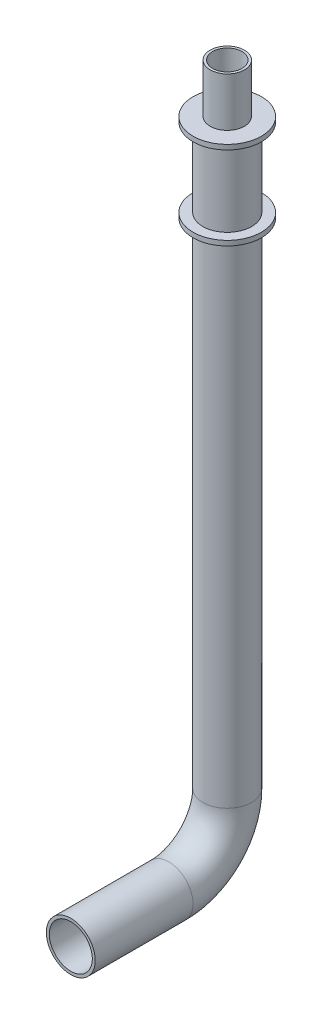
ISO-10303-21;
HEADER;
FILE_DESCRIPTION(('STEP AP214'),'2;1');
FILE_NAME('part.step','',(''),(''),'','','');
FILE_SCHEMA(('AUTOMOTIVE_DESIGN { 1 0 10303 214 1 1 1 1 }'));
ENDSEC;
DATA;
#1=APPLICATION_CONTEXT('core data for automotive mechanical design processes');
#2=APPLICATION_PROTOCOL_DEFINITION('international standard','automotive_design',2000,#1);
#3=PRODUCT_CONTEXT('',#1,'mechanical');
#4=PRODUCT('Part','Part','',(#3));
#5=PRODUCT_RELATED_PRODUCT_CATEGORY('part','',(#4));
#6=PRODUCT_DEFINITION_FORMATION('','',#4);
#7=PRODUCT_DEFINITION_CONTEXT('part definition',#1,'design');
#8=PRODUCT_DEFINITION('design','',#6,#7);
#9=PRODUCT_DEFINITION_SHAPE('','',#8);
#10=(LENGTH_UNIT() NAMED_UNIT(*) SI_UNIT(.MILLI.,.METRE.));
#11=(NAMED_UNIT(*) PLANE_ANGLE_UNIT() SI_UNIT($,.RADIAN.));
#12=(NAMED_UNIT(*) SI_UNIT($,.STERADIAN.) SOLID_ANGLE_UNIT());
#13=UNCERTAINTY_MEASURE_WITH_UNIT(LENGTH_MEASURE(1.E-05),#10,'distance_accuracy_value','');
#14=(GEOMETRIC_REPRESENTATION_CONTEXT(3) GLOBAL_UNCERTAINTY_ASSIGNED_CONTEXT((#13)) GLOBAL_UNIT_ASSIGNED_CONTEXT((#10,
#11,#12)) REPRESENTATION_CONTEXT('',''));
#15=CARTESIAN_POINT('',(0.,0.,0.));
#16=DIRECTION('',(0.,0.,1.));
#17=DIRECTION('',(1.,0.,0.));
#18=AXIS2_PLACEMENT_3D('',#15,#16,#17);
#19=CARTESIAN_POINT('',(0.,59.9999999999999,0.));
#20=DIRECTION('',(0.,1.,0.));
#21=DIRECTION('',(0.,0.,1.));
#22=AXIS2_PLACEMENT_3D('',#19,#20,#21);
#23=CYLINDRICAL_SURFACE('',#22,25.);
#24=CARTESIAN_POINT('',(0.,650.,0.));
#25=DIRECTION('',(0.,1.,0.));
#26=DIRECTION('',(0.,0.,1.));
#27=AXIS2_PLACEMENT_3D('',#24,#25,#26);
#28=CIRCLE('',#27,25.);
#29=CARTESIAN_POINT('',(0.,650.,25.));
#30=VERTEX_POINT('',#29);
#31=EDGE_CURVE('E101',#30,#30,#28,.T.);
#32=ORIENTED_EDGE('',*,*,#31,.F.);
#33=EDGE_LOOP('',(#32));
#34=FACE_BOUND('',#33,.T.);
#35=CARTESIAN_POINT('',(0.,570.,0.));
#36=DIRECTION('',(0.,-1.,0.));
#37=DIRECTION('',(0.,0.,-1.));
#38=AXIS2_PLACEMENT_3D('',#35,#36,#37);
#39=CIRCLE('',#38,25.);
#40=CARTESIAN_POINT('',(0.,570.,-25.));
#41=VERTEX_POINT('',#40);
#42=EDGE_CURVE('E63',#41,#41,#39,.F.);
#43=ORIENTED_EDGE('',*,*,#42,.T.);
#44=EDGE_LOOP('',(#43));
#45=FACE_BOUND('',#44,.T.);
#46=ADVANCED_FACE('F46',(#34,#45),#23,.T.);
#47=CARTESIAN_POINT('',(0.,650.,0.));
#48=DIRECTION('',(0.,1.,0.));
#49=DIRECTION('',(0.,0.,1.));
#50=AXIS2_PLACEMENT_3D('',#47,#48,#49);
#51=PLANE('',#50);
#52=ORIENTED_EDGE('',*,*,#31,.T.);
#53=EDGE_LOOP('',(#52));
#54=FACE_BOUND('',#53,.T.);
#55=CARTESIAN_POINT('',(0.,650.,0.));
#56=DIRECTION('',(0.,1.,0.));
#57=DIRECTION('',(0.,0.,1.));
#58=AXIS2_PLACEMENT_3D('',#55,#56,#57);
#59=CIRCLE('',#58,35.);
#60=CARTESIAN_POINT('',(0.,650.,35.));
#61=VERTEX_POINT('',#60);
#62=EDGE_CURVE('E72',#61,#61,#59,.T.);
#63=ORIENTED_EDGE('',*,*,#62,.F.);
#64=EDGE_LOOP('',(#63));
#65=FACE_BOUND('',#64,.T.);
#66=ADVANCED_FACE('F128',(#54,#65),#51,.F.);
#67=CARTESIAN_POINT('',(0.,655.,0.));
#68=DIRECTION('',(0.,1.,0.));
#69=DIRECTION('',(0.,0.,1.));
#70=AXIS2_PLACEMENT_3D('',#67,#68,#69);
#71=PLANE('',#70);
#72=CARTESIAN_POINT('',(0.,655.,0.));
#73=DIRECTION('',(0.,1.,0.));
#74=DIRECTION('',(0.,0.,1.));
#75=AXIS2_PLACEMENT_3D('',#72,#73,#74);
#76=CIRCLE('',#75,17.5);
#77=CARTESIAN_POINT('',(0.,655.,17.5));
#78=VERTEX_POINT('',#77);
#79=EDGE_CURVE('E68',#78,#78,#76,.T.);
#80=ORIENTED_EDGE('',*,*,#79,.F.);
#81=EDGE_LOOP('',(#80));
#82=FACE_BOUND('',#81,.T.);
#83=CARTESIAN_POINT('',(0.,655.,0.));
#84=DIRECTION('',(0.,1.,0.));
#85=DIRECTION('',(0.,0.,1.));
#86=AXIS2_PLACEMENT_3D('',#83,#84,#85);
#87=CIRCLE('',#86,35.);
#88=CARTESIAN_POINT('',(0.,655.,35.));
#89=VERTEX_POINT('',#88);
#90=EDGE_CURVE('E75',#89,#89,#87,.T.);
#91=ORIENTED_EDGE('',*,*,#90,.T.);
#92=EDGE_LOOP('',(#91));
#93=FACE_BOUND('',#92,.T.);
#94=ADVANCED_FACE('F113',(#82,#93),#71,.T.);
#95=CARTESIAN_POINT('',(0.,655.,0.));
#96=DIRECTION('',(0.,-1.,0.));
#97=DIRECTION('',(0.,0.,-1.));
#98=AXIS2_PLACEMENT_3D('',#95,#96,#97);
#99=CYLINDRICAL_SURFACE('',#98,35.);
#100=ORIENTED_EDGE('',*,*,#90,.F.);
#101=EDGE_LOOP('',(#100));
#102=FACE_BOUND('',#101,.T.);
#103=ORIENTED_EDGE('',*,*,#62,.T.);
#104=EDGE_LOOP('',(#103));
#105=FACE_BOUND('',#104,.T.);
#106=ADVANCED_FACE('F127',(#102,#105),#99,.T.);
#107=CARTESIAN_POINT('',(0.,705.,0.));
#108=DIRECTION('',(0.,1.,0.));
#109=DIRECTION('',(0.,0.,1.));
#110=AXIS2_PLACEMENT_3D('',#107,#108,#109);
#111=PLANE('',#110);
#112=CARTESIAN_POINT('',(0.,705.,0.));
#113=DIRECTION('',(0.,1.,0.));
#114=DIRECTION('',(0.,0.,1.));
#115=AXIS2_PLACEMENT_3D('',#112,#113,#114);
#116=CIRCLE('',#115,17.5);
#117=CARTESIAN_POINT('',(0.,705.,17.5));
#118=VERTEX_POINT('',#117);
#119=EDGE_CURVE('E69',#118,#118,#116,.T.);
#120=ORIENTED_EDGE('',*,*,#119,.T.);
#121=EDGE_LOOP('',(#120));
#122=FACE_BOUND('',#121,.T.);
#123=CARTESIAN_POINT('',(0.,705.,0.));
#124=DIRECTION('',(0.,1.,0.));
#125=DIRECTION('',(1.,0.,0.));
#126=AXIS2_PLACEMENT_3D('',#123,#124,#125);
#127=CIRCLE('',#126,15.);
#128=CARTESIAN_POINT('',(15.,705.,0.));
#129=VERTEX_POINT('',#128);
#130=EDGE_CURVE('E65',#129,#129,#127,.T.);
#131=ORIENTED_EDGE('',*,*,#130,.F.);
#132=EDGE_LOOP('',(#131));
#133=FACE_BOUND('',#132,.T.);
#134=ADVANCED_FACE('F184',(#122,#133),#111,.T.);
#135=CARTESIAN_POINT('',(0.,705.,0.));
#136=DIRECTION('',(0.,-1.,0.));
#137=DIRECTION('',(0.,0.,-1.));
#138=AXIS2_PLACEMENT_3D('',#135,#136,#137);
#139=CYLINDRICAL_SURFACE('',#138,17.5);
#140=ORIENTED_EDGE('',*,*,#119,.F.);
#141=EDGE_LOOP('',(#140));
#142=FACE_BOUND('',#141,.T.);
#143=ORIENTED_EDGE('',*,*,#79,.T.);
#144=EDGE_LOOP('',(#143));
#145=FACE_BOUND('',#144,.T.);
#146=ADVANCED_FACE('F121',(#142,#145),#139,.T.);
#147=CARTESIAN_POINT('',(0.,705.,0.));
#148=DIRECTION('',(0.,-1.,0.));
#149=DIRECTION('',(0.,0.,-1.));
#150=AXIS2_PLACEMENT_3D('',#147,#148,#149);
#151=CYLINDRICAL_SURFACE('',#150,15.);
#152=ORIENTED_EDGE('',*,*,#130,.T.);
#153=EDGE_LOOP('',(#152));
#154=FACE_BOUND('',#153,.T.);
#155=CARTESIAN_POINT('',(0.,655.,0.));
#156=DIRECTION('',(0.,1.,0.));
#157=DIRECTION('',(0.,0.,1.));
#158=AXIS2_PLACEMENT_3D('',#155,#156,#157);
#159=CIRCLE('',#158,15.);
#160=CARTESIAN_POINT('',(0.,655.,15.));
#161=VERTEX_POINT('',#160);
#162=EDGE_CURVE('E60',#161,#161,#159,.F.);
#163=ORIENTED_EDGE('',*,*,#162,.T.);
#164=EDGE_LOOP('',(#163));
#165=FACE_BOUND('',#164,.T.);
#166=ADVANCED_FACE('F107',(#154,#165),#151,.F.);
#167=ORIENTED_EDGE('',*,*,#162,.F.);
#168=EDGE_LOOP('',(#167));
#169=FACE_BOUND('',#168,.T.);
#170=ADVANCED_FACE('F109',(#169),#71,.T.);
#171=CARTESIAN_POINT('',(0.,565.,0.));
#172=DIRECTION('',(0.,1.,0.));
#173=DIRECTION('',(0.,0.,1.));
#174=AXIS2_PLACEMENT_3D('',#171,#172,#173);
#175=CYLINDRICAL_SURFACE('',#174,35.);
#176=CARTESIAN_POINT('',(0.,565.,0.));
#177=DIRECTION('',(0.,1.,0.));
#178=DIRECTION('',(0.,0.,1.));
#179=AXIS2_PLACEMENT_3D('',#176,#177,#178);
#180=CIRCLE('',#179,35.);
#181=CARTESIAN_POINT('',(0.,565.,35.));
#182=VERTEX_POINT('',#181);
#183=EDGE_CURVE('E214',#182,#182,#180,.T.);
#184=ORIENTED_EDGE('',*,*,#183,.T.);
#185=EDGE_LOOP('',(#184));
#186=FACE_BOUND('',#185,.T.);
#187=CARTESIAN_POINT('',(0.,570.,0.));
#188=DIRECTION('',(0.,1.,0.));
#189=DIRECTION('',(0.,0.,1.));
#190=AXIS2_PLACEMENT_3D('',#187,#188,#189);
#191=CIRCLE('',#190,35.);
#192=CARTESIAN_POINT('',(0.,570.,35.));
#193=VERTEX_POINT('',#192);
#194=EDGE_CURVE('E217',#193,#193,#191,.T.);
#195=ORIENTED_EDGE('',*,*,#194,.F.);
#196=EDGE_LOOP('',(#195));
#197=FACE_BOUND('',#196,.T.);
#198=ADVANCED_FACE('F111',(#186,#197),#175,.T.);
#199=CARTESIAN_POINT('',(0.,565.,0.));
#200=DIRECTION('',(0.,-1.,0.));
#201=DIRECTION('',(0.,0.,1.));
#202=AXIS2_PLACEMENT_3D('',#199,#200,#201);
#203=PLANE('',#202);
#204=CARTESIAN_POINT('',(0.,565.,0.));
#205=DIRECTION('',(0.,-1.,0.));
#206=DIRECTION('',(0.,0.,-1.));
#207=AXIS2_PLACEMENT_3D('',#204,#205,#206);
#208=CIRCLE('',#207,25.);
#209=CARTESIAN_POINT('',(0.,565.,-25.));
#210=VERTEX_POINT('',#209);
#211=EDGE_CURVE('E11',#210,#210,#208,.F.);
#212=ORIENTED_EDGE('',*,*,#211,.T.);
#213=EDGE_LOOP('',(#212));
#214=FACE_BOUND('',#213,.T.);
#215=ORIENTED_EDGE('',*,*,#183,.F.);
#216=EDGE_LOOP('',(#215));
#217=FACE_BOUND('',#216,.T.);
#218=ADVANCED_FACE('F118',(#214,#217),#203,.T.);
#219=CARTESIAN_POINT('',(0.,570.,0.));
#220=DIRECTION('',(0.,-1.,0.));
#221=DIRECTION('',(0.,0.,1.));
#222=AXIS2_PLACEMENT_3D('',#219,#220,#221);
#223=PLANE('',#222);
#224=ORIENTED_EDGE('',*,*,#42,.F.);
#225=EDGE_LOOP('',(#224));
#226=FACE_BOUND('',#225,.T.);
#227=ORIENTED_EDGE('',*,*,#194,.T.);
#228=EDGE_LOOP('',(#227));
#229=FACE_BOUND('',#228,.T.);
#230=ADVANCED_FACE('F159',(#226,#229),#223,.F.);
#231=CARTESIAN_POINT('',(0.,0.,160.));
#232=DIRECTION('',(0.,0.,-1.));
#233=DIRECTION('',(-1.,0.,0.));
#234=AXIS2_PLACEMENT_3D('',#231,#232,#233);
#235=CYLINDRICAL_SURFACE('',#234,25.);
#236=CARTESIAN_POINT('',(0.,0.,60.0000000000004));
#237=DIRECTION('',(0.,0.,-1.));
#238=DIRECTION('',(0.,1.,0.));
#239=AXIS2_PLACEMENT_3D('',#236,#237,#238);
#240=CIRCLE('',#239,25.);
#241=CARTESIAN_POINT('',(0.,-25.,60.0000000000004));
#242=VERTEX_POINT('',#241);
#243=EDGE_CURVE('E95',#242,#242,#240,.T.);
#244=ORIENTED_EDGE('',*,*,#243,.F.);
#245=EDGE_LOOP('',(#244));
#246=FACE_BOUND('',#245,.T.);
#247=CARTESIAN_POINT('',(0.,0.,160.));
#248=DIRECTION('',(0.,0.,-1.));
#249=DIRECTION('',(0.,1.,0.));
#250=AXIS2_PLACEMENT_3D('',#247,#248,#249);
#251=CIRCLE('',#250,25.);
#252=CARTESIAN_POINT('',(0.,25.,160.));
#253=VERTEX_POINT('',#252);
#254=EDGE_CURVE('E88',#253,#253,#251,.T.);
#255=ORIENTED_EDGE('',*,*,#254,.T.);
#256=EDGE_LOOP('',(#255));
#257=FACE_BOUND('',#256,.T.);
#258=ADVANCED_FACE('F150',(#246,#257),#235,.T.);
#259=CARTESIAN_POINT('',(-1.66533453693773E-13,60.,60.0000000000001));
#260=DIRECTION('',(1.,0.,0.));
#261=DIRECTION('',(0.,0.,-1.));
#262=AXIS2_PLACEMENT_3D('',#259,#260,#261);
#263=TOROIDAL_SURFACE('',#262,60.,25.);
#264=CARTESIAN_POINT('',(0.,60.0000000000001,0.));
#265=DIRECTION('',(0.,1.,0.));
#266=DIRECTION('',(0.,0.,1.));
#267=AXIS2_PLACEMENT_3D('',#264,#265,#266);
#268=CIRCLE('',#267,25.);
#269=CARTESIAN_POINT('',(0.,60.0000000000001,-24.9999999999999));
#270=VERTEX_POINT('',#269);
#271=EDGE_CURVE('E98',#270,#270,#268,.T.);
#272=CARTESIAN_POINT('',(-1.66533453693773E-13,60.,60.0000000000001));
#273=DIRECTION('',(1.,0.,0.));
#274=DIRECTION('',(0.,0.,-1.));
#275=AXIS2_PLACEMENT_3D('',#272,#273,#274);
#276=CIRCLE('',#275,85.);
#277=EDGE_CURVE('',#242,#270,#276,.T.);
#278=ORIENTED_EDGE('',*,*,#243,.T.);
#279=ORIENTED_EDGE('',*,*,#271,.F.);
#280=ORIENTED_EDGE('',*,*,#277,.T.);
#281=ORIENTED_EDGE('',*,*,#277,.F.);
#282=EDGE_LOOP('',(#278,#280,#279,#281));
#283=FACE_BOUND('',#282,.T.);
#284=ADVANCED_FACE('F142',(#283),#263,.T.);
#285=ORIENTED_EDGE('',*,*,#211,.F.);
#286=EDGE_LOOP('',(#285));
#287=FACE_BOUND('',#286,.T.);
#288=ORIENTED_EDGE('',*,*,#271,.T.);
#289=EDGE_LOOP('',(#288));
#290=FACE_BOUND('',#289,.T.);
#291=ADVANCED_FACE('F132',(#287,#290),#23,.T.);
#292=CARTESIAN_POINT('',(0.,0.,160.));
#293=DIRECTION('',(0.,0.,-1.));
#294=DIRECTION('',(0.,1.,0.));
#295=AXIS2_PLACEMENT_3D('',#292,#293,#294);
#296=PLANE('',#295);
#297=CARTESIAN_POINT('',(0.,0.,160.));
#298=DIRECTION('',(0.,0.,-1.));
#299=DIRECTION('',(-1.,0.,0.));
#300=AXIS2_PLACEMENT_3D('',#297,#298,#299);
#301=CIRCLE('',#300,22.);
#302=CARTESIAN_POINT('',(-22.,0.,160.));
#303=VERTEX_POINT('',#302);
#304=EDGE_CURVE('E85',#303,#303,#301,.T.);
#305=ORIENTED_EDGE('',*,*,#304,.T.);
#306=EDGE_LOOP('',(#305));
#307=FACE_BOUND('',#306,.T.);
#308=ORIENTED_EDGE('',*,*,#254,.F.);
#309=EDGE_LOOP('',(#308));
#310=FACE_BOUND('',#309,.T.);
#311=ADVANCED_FACE('F48',(#307,#310),#296,.F.);
#312=CARTESIAN_POINT('',(0.,0.,160.));
#313=DIRECTION('',(0.,0.,-1.));
#314=DIRECTION('',(-1.,0.,0.));
#315=AXIS2_PLACEMENT_3D('',#312,#313,#314);
#316=CYLINDRICAL_SURFACE('',#315,22.);
#317=CARTESIAN_POINT('',(0.,0.,60.0000000000002));
#318=DIRECTION('',(0.,0.,1.));
#319=DIRECTION('',(0.,-1.,0.));
#320=AXIS2_PLACEMENT_3D('',#317,#318,#319);
#321=CIRCLE('',#320,22.);
#322=CARTESIAN_POINT('',(0.,-22.,60.0000000000002));
#323=VERTEX_POINT('',#322);
#324=EDGE_CURVE('E81',#323,#323,#321,.F.);
#325=ORIENTED_EDGE('',*,*,#324,.T.);
#326=EDGE_LOOP('',(#325));
#327=FACE_BOUND('',#326,.T.);
#328=ORIENTED_EDGE('',*,*,#304,.F.);
#329=EDGE_LOOP('',(#328));
#330=FACE_BOUND('',#329,.T.);
#331=ADVANCED_FACE('F148',(#327,#330),#316,.F.);
#332=CARTESIAN_POINT('',(-1.66533453693773E-13,60.,60.0000000000001));
#333=DIRECTION('',(1.,0.,0.));
#334=DIRECTION('',(0.,0.,-1.));
#335=AXIS2_PLACEMENT_3D('',#332,#333,#334);
#336=TOROIDAL_SURFACE('',#335,60.,22.);
#337=CARTESIAN_POINT('',(0.,60.0000000000001,0.));
#338=DIRECTION('',(0.,1.,0.));
#339=DIRECTION('',(0.,0.,1.));
#340=AXIS2_PLACEMENT_3D('',#337,#338,#339);
#341=CIRCLE('',#340,22.);
#342=CARTESIAN_POINT('',(0.,60.0000000000001,-21.9999999999999));
#343=VERTEX_POINT('',#342);
#344=EDGE_CURVE('E84',#343,#343,#341,.T.);
#345=CARTESIAN_POINT('',(-1.66533453693773E-13,60.,60.0000000000001));
#346=DIRECTION('',(1.,0.,0.));
#347=DIRECTION('',(0.,0.,-1.));
#348=AXIS2_PLACEMENT_3D('',#345,#346,#347);
#349=CIRCLE('',#348,82.);
#350=EDGE_CURVE('',#323,#343,#349,.T.);
#351=ORIENTED_EDGE('',*,*,#324,.F.);
#352=ORIENTED_EDGE('',*,*,#344,.T.);
#353=ORIENTED_EDGE('',*,*,#350,.T.);
#354=ORIENTED_EDGE('',*,*,#350,.F.);
#355=EDGE_LOOP('',(#351,#353,#352,#354));
#356=FACE_BOUND('',#355,.T.);
#357=ADVANCED_FACE('F174',(#356),#336,.F.);
#358=CARTESIAN_POINT('',(0.,59.9999999999999,0.));
#359=DIRECTION('',(0.,1.,0.));
#360=DIRECTION('',(0.,0.,1.));
#361=AXIS2_PLACEMENT_3D('',#358,#359,#360);
#362=CYLINDRICAL_SURFACE('',#361,22.);
#363=CARTESIAN_POINT('',(0.,565.,0.));
#364=DIRECTION('',(0.,-1.,0.));
#365=DIRECTION('',(0.,0.,-1.));
#366=AXIS2_PLACEMENT_3D('',#363,#364,#365);
#367=CIRCLE('',#366,22.);
#368=CARTESIAN_POINT('',(0.,565.,-22.));
#369=VERTEX_POINT('',#368);
#370=EDGE_CURVE('E50',#369,#369,#367,.F.);
#371=ORIENTED_EDGE('',*,*,#370,.T.);
#372=EDGE_LOOP('',(#371));
#373=FACE_BOUND('',#372,.T.);
#374=ORIENTED_EDGE('',*,*,#344,.F.);
#375=EDGE_LOOP('',(#374));
#376=FACE_BOUND('',#375,.T.);
#377=ADVANCED_FACE('F170',(#373,#376),#362,.F.);
#378=ORIENTED_EDGE('',*,*,#370,.F.);
#379=EDGE_LOOP('',(#378));
#380=FACE_BOUND('',#379,.T.);
#381=ADVANCED_FACE('F173',(#380),#203,.T.);
#382=CLOSED_SHELL('',(#46,#66,#94,#106,#134,#146,#166,#170,#198,#218,#230,#258,#284,#291,#311,
#331,#357,#377,#381));
#383=CARTESIAN_POINT('',(0.,570.,0.));
#384=DIRECTION('',(0.,-1.,0.));
#385=DIRECTION('',(0.,0.,-1.));
#386=AXIS2_PLACEMENT_3D('',#383,#384,#385);
#387=CIRCLE('',#386,22.);
#388=CARTESIAN_POINT('',(0.,570.,-22.));
#389=VERTEX_POINT('',#388);
#390=EDGE_CURVE('E55',#389,#389,#387,.F.);
#391=ORIENTED_EDGE('',*,*,#390,.T.);
#392=EDGE_LOOP('',(#391));
#393=FACE_BOUND('',#392,.T.);
#394=ADVANCED_FACE('F168',(#393),#223,.F.);
#395=CARTESIAN_POINT('',(0.,650.,0.));
#396=DIRECTION('',(0.,1.,0.));
#397=DIRECTION('',(0.,0.,1.));
#398=AXIS2_PLACEMENT_3D('',#395,#396,#397);
#399=CIRCLE('',#398,22.);
#400=CARTESIAN_POINT('',(0.,650.,22.));
#401=VERTEX_POINT('',#400);
#402=EDGE_CURVE('E78',#401,#401,#399,.T.);
#403=ORIENTED_EDGE('',*,*,#402,.F.);
#404=EDGE_LOOP('',(#403));
#405=FACE_BOUND('',#404,.T.);
#406=ADVANCED_FACE('F137',(#405),#51,.F.);
#407=ORIENTED_EDGE('',*,*,#402,.T.);
#408=EDGE_LOOP('',(#407));
#409=FACE_BOUND('',#408,.T.);
#410=ORIENTED_EDGE('',*,*,#390,.F.);
#411=EDGE_LOOP('',(#410));
#412=FACE_BOUND('',#411,.T.);
#413=ADVANCED_FACE('F176',(#409,#412),#362,.F.);
#414=CLOSED_SHELL('',(#394,#406,#413));
#415=ORIENTED_CLOSED_SHELL('',*,#414,.T.);
#416=BREP_WITH_VOIDS('B2',#382,(#415));
#417=ADVANCED_BREP_SHAPE_REPRESENTATION('',(#18,#416),#14);
#418=SHAPE_DEFINITION_REPRESENTATION(#9,#417);
ENDSEC;
END-ISO-10303-21;
